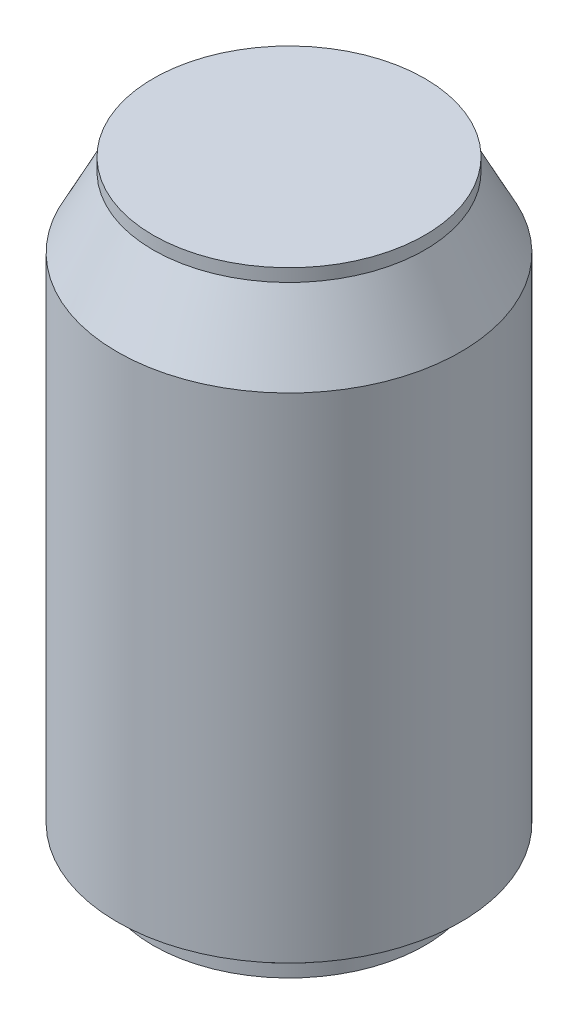
ISO-10303-21;
HEADER;
FILE_DESCRIPTION(('STEP AP214'),'2;1');
FILE_NAME('part.step','',(''),(''),'','','');
FILE_SCHEMA(('AUTOMOTIVE_DESIGN { 1 0 10303 214 1 1 1 1 }'));
ENDSEC;
DATA;
#1=APPLICATION_CONTEXT('core data for automotive mechanical design processes');
#2=APPLICATION_PROTOCOL_DEFINITION('international standard','automotive_design',2000,#1);
#3=PRODUCT_CONTEXT('',#1,'mechanical');
#4=PRODUCT('Part','Part','',(#3));
#5=PRODUCT_RELATED_PRODUCT_CATEGORY('part','',(#4));
#6=PRODUCT_DEFINITION_FORMATION('','',#4);
#7=PRODUCT_DEFINITION_CONTEXT('part definition',#1,'design');
#8=PRODUCT_DEFINITION('design','',#6,#7);
#9=PRODUCT_DEFINITION_SHAPE('','',#8);
#10=(LENGTH_UNIT() NAMED_UNIT(*) SI_UNIT(.MILLI.,.METRE.));
#11=(NAMED_UNIT(*) PLANE_ANGLE_UNIT() SI_UNIT($,.RADIAN.));
#12=(NAMED_UNIT(*) SI_UNIT($,.STERADIAN.) SOLID_ANGLE_UNIT());
#13=UNCERTAINTY_MEASURE_WITH_UNIT(LENGTH_MEASURE(1.E-05),#10,'distance_accuracy_value','');
#14=(GEOMETRIC_REPRESENTATION_CONTEXT(3) GLOBAL_UNCERTAINTY_ASSIGNED_CONTEXT((#13)) GLOBAL_UNIT_ASSIGNED_CONTEXT((#10,
#11,#12)) REPRESENTATION_CONTEXT('',''));
#15=CARTESIAN_POINT('',(0.,0.,0.));
#16=DIRECTION('',(0.,0.,1.));
#17=DIRECTION('',(1.,0.,0.));
#18=AXIS2_PLACEMENT_3D('',#15,#16,#17);
#19=CARTESIAN_POINT('',(26.9875,0.,0.));
#20=DIRECTION('',(0.,-1.,0.));
#21=DIRECTION('',(0.,0.,-1.));
#22=AXIS2_PLACEMENT_3D('',#19,#20,#21);
#23=PLANE('',#22);
#24=DIRECTION('',(0.,0.,-1.));
#25=VECTOR('',#24,1.);
#26=CARTESIAN_POINT('',(0.,0.,0.));
#27=LINE('',#26,#25);
#28=CARTESIAN_POINT('',(0.,0.,12.7));
#29=VERTEX_POINT('',#28);
#30=CARTESIAN_POINT('',(0.,0.,0.));
#31=VERTEX_POINT('',#30);
#32=EDGE_CURVE('E47',#29,#31,#27,.T.);
#33=ORIENTED_EDGE('',*,*,#32,.F.);
#34=DIRECTION('',(-1.,0.,0.));
#35=VECTOR('',#34,1.);
#36=CARTESIAN_POINT('',(0.,0.,12.7));
#37=LINE('',#36,#35);
#38=CARTESIAN_POINT('',(12.7,0.,12.7));
#39=VERTEX_POINT('',#38);
#40=EDGE_CURVE('E124',#39,#29,#37,.T.);
#41=ORIENTED_EDGE('',*,*,#40,.F.);
#42=DIRECTION('',(0.,0.,1.));
#43=VECTOR('',#42,1.);
#44=CARTESIAN_POINT('',(12.7,0.,0.));
#45=LINE('',#44,#43);
#46=CARTESIAN_POINT('',(12.7,0.,0.));
#47=VERTEX_POINT('',#46);
#48=EDGE_CURVE('E127',#47,#39,#45,.T.);
#49=ORIENTED_EDGE('',*,*,#48,.F.);
#50=DIRECTION('',(1.,0.,0.));
#51=VECTOR('',#50,1.);
#52=CARTESIAN_POINT('',(0.,0.,0.));
#53=LINE('',#52,#51);
#54=EDGE_CURVE('E133',#31,#47,#53,.T.);
#55=ORIENTED_EDGE('',*,*,#54,.F.);
#56=EDGE_LOOP('',(#33,#41,#49,#55));
#57=FACE_BOUND('',#56,.T.);
#58=CARTESIAN_POINT('',(0.,0.,0.));
#59=DIRECTION('',(0.,-1.,0.));
#60=DIRECTION('',(0.,0.,-1.));
#61=AXIS2_PLACEMENT_3D('',#58,#59,#60);
#62=CIRCLE('',#61,26.9875);
#63=CARTESIAN_POINT('',(0.,0.,-26.9875));
#64=VERTEX_POINT('',#63);
#65=EDGE_CURVE('E165',#64,#64,#62,.T.);
#66=ORIENTED_EDGE('',*,*,#65,.T.);
#67=EDGE_LOOP('',(#66));
#68=FACE_BOUND('',#67,.T.);
#69=ADVANCED_FACE('F33',(#57,#68),#23,.T.);
#70=CARTESIAN_POINT('',(0.,122.2375,0.));
#71=DIRECTION('',(0.,1.,0.));
#72=DIRECTION('',(0.,0.,1.));
#73=AXIS2_PLACEMENT_3D('',#70,#71,#72);
#74=PLANE('',#73);
#75=CARTESIAN_POINT('',(0.,122.2375,0.));
#76=DIRECTION('',(0.,-1.,0.));
#77=DIRECTION('',(0.,0.,-1.));
#78=AXIS2_PLACEMENT_3D('',#75,#76,#77);
#79=CIRCLE('',#78,26.9875);
#80=CARTESIAN_POINT('',(0.,122.2375,-26.9875));
#81=VERTEX_POINT('',#80);
#82=EDGE_CURVE('E181',#81,#81,#79,.T.);
#83=ORIENTED_EDGE('',*,*,#82,.F.);
#84=EDGE_LOOP('',(#83));
#85=FACE_BOUND('',#84,.T.);
#86=ADVANCED_FACE('F232',(#85),#74,.T.);
#87=CARTESIAN_POINT('',(0.,0.,0.));
#88=DIRECTION('',(0.,-1.,0.));
#89=DIRECTION('',(0.,0.,-1.));
#90=AXIS2_PLACEMENT_3D('',#87,#88,#89);
#91=CYLINDRICAL_SURFACE('',#90,26.9875);
#92=ORIENTED_EDGE('',*,*,#82,.T.);
#93=EDGE_LOOP('',(#92));
#94=FACE_BOUND('',#93,.T.);
#95=CARTESIAN_POINT('',(0.,119.6975,0.));
#96=DIRECTION('',(0.,-1.,0.));
#97=DIRECTION('',(0.,0.,-1.));
#98=AXIS2_PLACEMENT_3D('',#95,#96,#97);
#99=CIRCLE('',#98,26.9875);
#100=CARTESIAN_POINT('',(0.,119.6975,-26.9875));
#101=VERTEX_POINT('',#100);
#102=EDGE_CURVE('E179',#101,#101,#99,.T.);
#103=ORIENTED_EDGE('',*,*,#102,.F.);
#104=EDGE_LOOP('',(#103));
#105=FACE_BOUND('',#104,.T.);
#106=ADVANCED_FACE('F239',(#94,#105),#91,.T.);
#107=CARTESIAN_POINT('',(0.,105.7275,0.));
#108=DIRECTION('',(0.,-1.,0.));
#109=DIRECTION('',(0.,0.,-1.));
#110=AXIS2_PLACEMENT_3D('',#107,#108,#109);
#111=CONICAL_SURFACE('',#110,34.13125,0.47269713571459);
#112=ORIENTED_EDGE('',*,*,#102,.T.);
#113=EDGE_LOOP('',(#112));
#114=FACE_BOUND('',#113,.T.);
#115=CARTESIAN_POINT('',(0.,105.7275,0.));
#116=DIRECTION('',(0.,-1.,0.));
#117=DIRECTION('',(0.,0.,-1.));
#118=AXIS2_PLACEMENT_3D('',#115,#116,#117);
#119=CIRCLE('',#118,34.13125);
#120=CARTESIAN_POINT('',(0.,105.7275,-34.13125));
#121=VERTEX_POINT('',#120);
#122=EDGE_CURVE('E175',#121,#121,#119,.T.);
#123=ORIENTED_EDGE('',*,*,#122,.F.);
#124=EDGE_LOOP('',(#123));
#125=FACE_BOUND('',#124,.T.);
#126=ADVANCED_FACE('F259',(#114,#125),#111,.T.);
#127=CARTESIAN_POINT('',(0.,0.,0.));
#128=DIRECTION('',(0.,-1.,0.));
#129=DIRECTION('',(0.,0.,-1.));
#130=AXIS2_PLACEMENT_3D('',#127,#128,#129);
#131=CYLINDRICAL_SURFACE('',#130,34.13125);
#132=DIRECTION('',(0.,-1.,0.));
#133=VECTOR('',#132,1.);
#134=CARTESIAN_POINT('',(-32.7752437300243,0.,9.525));
#135=LINE('',#134,#133);
#136=CARTESIAN_POINT('',(-32.7752437300244,7.62,9.525));
#137=VERTEX_POINT('',#136);
#138=CARTESIAN_POINT('',(-32.7752437300243,26.67,9.525));
#139=VERTEX_POINT('',#138);
#140=EDGE_CURVE('E163',#137,#139,#135,.F.);
#141=ORIENTED_EDGE('',*,*,#140,.F.);
#142=CARTESIAN_POINT('',(0.,7.62,0.));
#143=DIRECTION('',(0.,-1.,0.));
#144=DIRECTION('',(0.,0.,-1.));
#145=AXIS2_PLACEMENT_3D('',#142,#143,#144);
#146=CIRCLE('',#145,34.13125);
#147=CARTESIAN_POINT('',(-32.7752437300244,7.62,-9.52500000000001));
#148=VERTEX_POINT('',#147);
#149=EDGE_CURVE('E171',#148,#137,#146,.T.);
#150=ORIENTED_EDGE('',*,*,#149,.F.);
#151=DIRECTION('',(0.,-1.,0.));
#152=VECTOR('',#151,1.);
#153=CARTESIAN_POINT('',(-32.7752437300243,0.,-9.52500000000001));
#154=LINE('',#153,#152);
#155=CARTESIAN_POINT('',(-32.7752437300243,26.67,-9.525));
#156=VERTEX_POINT('',#155);
#157=EDGE_CURVE('E156',#156,#148,#154,.T.);
#158=ORIENTED_EDGE('',*,*,#157,.F.);
#159=CARTESIAN_POINT('',(0.,26.67,0.));
#160=DIRECTION('',(0.,1.,0.));
#161=DIRECTION('',(0.,0.,1.));
#162=AXIS2_PLACEMENT_3D('',#159,#160,#161);
#163=CIRCLE('',#162,34.13125);
#164=CARTESIAN_POINT('',(-34.13125,26.67,0.));
#165=VERTEX_POINT('',#164);
#166=EDGE_CURVE('E36',#165,#156,#163,.F.);
#167=ORIENTED_EDGE('',*,*,#166,.F.);
#168=EDGE_CURVE('E11',#139,#165,#163,.F.);
#169=ORIENTED_EDGE('',*,*,#168,.F.);
#170=EDGE_LOOP('',(#141,#150,#158,#167,#169));
#171=FACE_BOUND('',#170,.T.);
#172=ORIENTED_EDGE('',*,*,#122,.T.);
#173=EDGE_LOOP('',(#172));
#174=FACE_BOUND('',#173,.T.);
#175=ADVANCED_FACE('F200',(#171,#174),#131,.T.);
#176=CARTESIAN_POINT('',(0.,2.54,0.));
#177=DIRECTION('',(0.,1.,0.));
#178=DIRECTION('',(0.,0.,1.));
#179=AXIS2_PLACEMENT_3D('',#176,#177,#178);
#180=CONICAL_SURFACE('',#179,26.9875,0.952652100859711);
#181=CARTESIAN_POINT('',(-34.13125,7.62,0.));
#182=VERTEX_POINT('',#181);
#183=EDGE_CURVE('E172',#137,#182,#146,.T.);
#184=ORIENTED_EDGE('',*,*,#183,.T.);
#185=EDGE_CURVE('E176',#182,#148,#146,.T.);
#186=ORIENTED_EDGE('',*,*,#185,.T.);
#187=ORIENTED_EDGE('',*,*,#149,.T.);
#188=EDGE_LOOP('',(#184,#186,#187));
#189=FACE_BOUND('',#188,.T.);
#190=CARTESIAN_POINT('',(0.,2.54,0.));
#191=DIRECTION('',(0.,-1.,0.));
#192=DIRECTION('',(0.,0.,-1.));
#193=AXIS2_PLACEMENT_3D('',#190,#191,#192);
#194=CIRCLE('',#193,26.9875);
#195=CARTESIAN_POINT('',(0.,2.54,-26.9875));
#196=VERTEX_POINT('',#195);
#197=EDGE_CURVE('E168',#196,#196,#194,.T.);
#198=ORIENTED_EDGE('',*,*,#197,.F.);
#199=EDGE_LOOP('',(#198));
#200=FACE_BOUND('',#199,.T.);
#201=ADVANCED_FACE('F206',(#189,#200),#180,.T.);
#202=CARTESIAN_POINT('',(0.,0.,0.));
#203=DIRECTION('',(0.,-1.,0.));
#204=DIRECTION('',(0.,0.,-1.));
#205=AXIS2_PLACEMENT_3D('',#202,#203,#204);
#206=CYLINDRICAL_SURFACE('',#205,26.9875);
#207=ORIENTED_EDGE('',*,*,#197,.T.);
#208=EDGE_LOOP('',(#207));
#209=FACE_BOUND('',#208,.T.);
#210=ORIENTED_EDGE('',*,*,#65,.F.);
#211=EDGE_LOOP('',(#210));
#212=FACE_BOUND('',#211,.T.);
#213=ADVANCED_FACE('F245',(#209,#212),#206,.T.);
#214=CARTESIAN_POINT('',(-26.51125,26.67,9.525));
#215=DIRECTION('',(0.,1.,0.));
#216=DIRECTION('',(0.,0.,1.));
#217=AXIS2_PLACEMENT_3D('',#214,#215,#216);
#218=PLANE('',#217);
#219=DIRECTION('',(-1.,0.,0.));
#220=VECTOR('',#219,1.);
#221=CARTESIAN_POINT('',(-26.51125,26.67,9.525));
#222=LINE('',#221,#220);
#223=CARTESIAN_POINT('',(-34.13125,26.67,9.525));
#224=VERTEX_POINT('',#223);
#225=EDGE_CURVE('E153',#139,#224,#222,.T.);
#226=ORIENTED_EDGE('',*,*,#225,.F.);
#227=ORIENTED_EDGE('',*,*,#168,.T.);
#228=DIRECTION('',(0.,0.,-1.));
#229=VECTOR('',#228,1.);
#230=CARTESIAN_POINT('',(-34.13125,26.67,9.525));
#231=LINE('',#230,#229);
#232=EDGE_CURVE('E146',#224,#165,#231,.T.);
#233=ORIENTED_EDGE('',*,*,#232,.F.);
#234=EDGE_LOOP('',(#226,#227,#233));
#235=FACE_BOUND('',#234,.T.);
#236=ADVANCED_FACE('F215',(#235),#218,.T.);
#237=CARTESIAN_POINT('',(-26.51125,7.62,9.525));
#238=DIRECTION('',(0.,-1.,0.));
#239=DIRECTION('',(0.,0.,-1.));
#240=AXIS2_PLACEMENT_3D('',#237,#238,#239);
#241=PLANE('',#240);
#242=DIRECTION('',(-1.,0.,0.));
#243=VECTOR('',#242,1.);
#244=CARTESIAN_POINT('',(-26.51125,7.62,-9.52500000000001));
#245=LINE('',#244,#243);
#246=CARTESIAN_POINT('',(-34.13125,7.62,-9.52500000000001));
#247=VERTEX_POINT('',#246);
#248=EDGE_CURVE('E157',#148,#247,#245,.T.);
#249=ORIENTED_EDGE('',*,*,#248,.F.);
#250=ORIENTED_EDGE('',*,*,#185,.F.);
#251=DIRECTION('',(0.,0.,1.));
#252=VECTOR('',#251,1.);
#253=CARTESIAN_POINT('',(-34.13125,7.62,9.525));
#254=LINE('',#253,#252);
#255=EDGE_CURVE('E55',#247,#182,#254,.T.);
#256=ORIENTED_EDGE('',*,*,#255,.F.);
#257=EDGE_LOOP('',(#249,#250,#256));
#258=FACE_BOUND('',#257,.T.);
#259=ADVANCED_FACE('F209',(#258),#241,.T.);
#260=CARTESIAN_POINT('',(-34.13125,0.,0.));
#261=DIRECTION('',(1.,0.,0.));
#262=DIRECTION('',(0.,0.,-1.));
#263=AXIS2_PLACEMENT_3D('',#260,#261,#262);
#264=PLANE('',#263);
#265=ORIENTED_EDGE('',*,*,#255,.T.);
#266=CARTESIAN_POINT('',(-34.13125,7.62,9.525));
#267=VERTEX_POINT('',#266);
#268=EDGE_CURVE('E151',#182,#267,#254,.T.);
#269=ORIENTED_EDGE('',*,*,#268,.T.);
#270=DIRECTION('',(0.,1.,0.));
#271=VECTOR('',#270,1.);
#272=CARTESIAN_POINT('',(-34.13125,26.67,9.525));
#273=LINE('',#272,#271);
#274=EDGE_CURVE('E139',#267,#224,#273,.T.);
#275=ORIENTED_EDGE('',*,*,#274,.T.);
#276=ORIENTED_EDGE('',*,*,#232,.T.);
#277=CARTESIAN_POINT('',(-34.13125,26.67,-9.525));
#278=VERTEX_POINT('',#277);
#279=EDGE_CURVE('E145',#165,#278,#231,.T.);
#280=ORIENTED_EDGE('',*,*,#279,.T.);
#281=DIRECTION('',(0.,-1.,0.));
#282=VECTOR('',#281,1.);
#283=CARTESIAN_POINT('',(-34.13125,26.67,-9.525));
#284=LINE('',#283,#282);
#285=EDGE_CURVE('E149',#278,#247,#284,.T.);
#286=ORIENTED_EDGE('',*,*,#285,.T.);
#287=EDGE_LOOP('',(#265,#269,#275,#276,#280,#286));
#288=FACE_BOUND('',#287,.T.);
#289=ADVANCED_FACE('F210',(#288),#264,.F.);
#290=CARTESIAN_POINT('',(-26.51125,26.67,9.525));
#291=DIRECTION('',(0.,0.,1.));
#292=DIRECTION('',(0.,-1.,0.));
#293=AXIS2_PLACEMENT_3D('',#290,#291,#292);
#294=PLANE('',#293);
#295=DIRECTION('',(-1.,0.,0.));
#296=VECTOR('',#295,1.);
#297=CARTESIAN_POINT('',(-26.51125,7.62,9.525));
#298=LINE('',#297,#296);
#299=EDGE_CURVE('E154',#137,#267,#298,.T.);
#300=ORIENTED_EDGE('',*,*,#299,.F.);
#301=ORIENTED_EDGE('',*,*,#140,.T.);
#302=ORIENTED_EDGE('',*,*,#225,.T.);
#303=ORIENTED_EDGE('',*,*,#274,.F.);
#304=EDGE_LOOP('',(#300,#301,#302,#303));
#305=FACE_BOUND('',#304,.T.);
#306=ADVANCED_FACE('F218',(#305),#294,.T.);
#307=ORIENTED_EDGE('',*,*,#268,.F.);
#308=ORIENTED_EDGE('',*,*,#183,.F.);
#309=ORIENTED_EDGE('',*,*,#299,.T.);
#310=EDGE_LOOP('',(#307,#308,#309));
#311=FACE_BOUND('',#310,.T.);
#312=ADVANCED_FACE('F220',(#311),#241,.T.);
#313=CARTESIAN_POINT('',(-26.51125,26.67,-9.525));
#314=DIRECTION('',(0.,0.,-1.));
#315=DIRECTION('',(0.,1.,0.));
#316=AXIS2_PLACEMENT_3D('',#313,#314,#315);
#317=PLANE('',#316);
#318=DIRECTION('',(-1.,0.,0.));
#319=VECTOR('',#318,1.);
#320=CARTESIAN_POINT('',(-26.51125,26.67,-9.525));
#321=LINE('',#320,#319);
#322=EDGE_CURVE('E159',#156,#278,#321,.T.);
#323=ORIENTED_EDGE('',*,*,#322,.F.);
#324=ORIENTED_EDGE('',*,*,#157,.T.);
#325=ORIENTED_EDGE('',*,*,#248,.T.);
#326=ORIENTED_EDGE('',*,*,#285,.F.);
#327=EDGE_LOOP('',(#323,#324,#325,#326));
#328=FACE_BOUND('',#327,.T.);
#329=ADVANCED_FACE('F196',(#328),#317,.T.);
#330=ORIENTED_EDGE('',*,*,#279,.F.);
#331=ORIENTED_EDGE('',*,*,#166,.T.);
#332=ORIENTED_EDGE('',*,*,#322,.T.);
#333=EDGE_LOOP('',(#330,#331,#332));
#334=FACE_BOUND('',#333,.T.);
#335=ADVANCED_FACE('F189',(#334),#218,.T.);
#336=CARTESIAN_POINT('',(0.,25.4,0.));
#337=DIRECTION('',(-1.,0.,0.));
#338=DIRECTION('',(0.,0.,1.));
#339=AXIS2_PLACEMENT_3D('',#336,#337,#338);
#340=PLANE('',#339);
#341=ORIENTED_EDGE('',*,*,#32,.T.);
#342=DIRECTION('',(0.,-1.,0.));
#343=VECTOR('',#342,1.);
#344=CARTESIAN_POINT('',(0.,25.4,0.));
#345=LINE('',#344,#343);
#346=CARTESIAN_POINT('',(0.,25.4,0.));
#347=VERTEX_POINT('',#346);
#348=EDGE_CURVE('E102',#347,#31,#345,.T.);
#349=ORIENTED_EDGE('',*,*,#348,.F.);
#350=DIRECTION('',(0.,0.,-1.));
#351=VECTOR('',#350,1.);
#352=CARTESIAN_POINT('',(0.,25.4,0.));
#353=LINE('',#352,#351);
#354=CARTESIAN_POINT('',(0.,25.4,12.7));
#355=VERTEX_POINT('',#354);
#356=EDGE_CURVE('E106',#355,#347,#353,.T.);
#357=ORIENTED_EDGE('',*,*,#356,.F.);
#358=DIRECTION('',(0.,-1.,0.));
#359=VECTOR('',#358,1.);
#360=CARTESIAN_POINT('',(0.,25.4,12.7));
#361=LINE('',#360,#359);
#362=EDGE_CURVE('E137',#355,#29,#361,.T.);
#363=ORIENTED_EDGE('',*,*,#362,.T.);
#364=EDGE_LOOP('',(#341,#349,#357,#363));
#365=FACE_BOUND('',#364,.T.);
#366=ADVANCED_FACE('F104',(#365),#340,.F.);
#367=CARTESIAN_POINT('',(0.,25.4,12.7));
#368=DIRECTION('',(0.,0.,1.));
#369=DIRECTION('',(1.,0.,0.));
#370=AXIS2_PLACEMENT_3D('',#367,#368,#369);
#371=PLANE('',#370);
#372=ORIENTED_EDGE('',*,*,#40,.T.);
#373=ORIENTED_EDGE('',*,*,#362,.F.);
#374=DIRECTION('',(-1.,0.,0.));
#375=VECTOR('',#374,1.);
#376=CARTESIAN_POINT('',(0.,25.4,12.7));
#377=LINE('',#376,#375);
#378=CARTESIAN_POINT('',(12.7,25.4,12.7));
#379=VERTEX_POINT('',#378);
#380=EDGE_CURVE('E112',#379,#355,#377,.T.);
#381=ORIENTED_EDGE('',*,*,#380,.F.);
#382=DIRECTION('',(0.,-1.,0.));
#383=VECTOR('',#382,1.);
#384=CARTESIAN_POINT('',(12.7,25.4,12.7));
#385=LINE('',#384,#383);
#386=EDGE_CURVE('E140',#379,#39,#385,.T.);
#387=ORIENTED_EDGE('',*,*,#386,.T.);
#388=EDGE_LOOP('',(#372,#373,#381,#387));
#389=FACE_BOUND('',#388,.T.);
#390=ADVANCED_FACE('F335',(#389),#371,.F.);
#391=CARTESIAN_POINT('',(12.7,25.4,0.));
#392=DIRECTION('',(1.,0.,0.));
#393=DIRECTION('',(0.,0.,-1.));
#394=AXIS2_PLACEMENT_3D('',#391,#392,#393);
#395=PLANE('',#394);
#396=ORIENTED_EDGE('',*,*,#48,.T.);
#397=ORIENTED_EDGE('',*,*,#386,.F.);
#398=DIRECTION('',(0.,0.,1.));
#399=VECTOR('',#398,1.);
#400=CARTESIAN_POINT('',(12.7,25.4,0.));
#401=LINE('',#400,#399);
#402=CARTESIAN_POINT('',(12.7,25.4,0.));
#403=VERTEX_POINT('',#402);
#404=EDGE_CURVE('E120',#403,#379,#401,.T.);
#405=ORIENTED_EDGE('',*,*,#404,.F.);
#406=DIRECTION('',(0.,-1.,0.));
#407=VECTOR('',#406,1.);
#408=CARTESIAN_POINT('',(12.7,25.4,0.));
#409=LINE('',#408,#407);
#410=EDGE_CURVE('E111',#403,#47,#409,.T.);
#411=ORIENTED_EDGE('',*,*,#410,.T.);
#412=EDGE_LOOP('',(#396,#397,#405,#411));
#413=FACE_BOUND('',#412,.T.);
#414=ADVANCED_FACE('F341',(#413),#395,.F.);
#415=CARTESIAN_POINT('',(0.,25.4,0.));
#416=DIRECTION('',(0.,0.,-1.));
#417=DIRECTION('',(-1.,0.,0.));
#418=AXIS2_PLACEMENT_3D('',#415,#416,#417);
#419=PLANE('',#418);
#420=ORIENTED_EDGE('',*,*,#54,.T.);
#421=ORIENTED_EDGE('',*,*,#410,.F.);
#422=DIRECTION('',(1.,0.,0.));
#423=VECTOR('',#422,1.);
#424=CARTESIAN_POINT('',(0.,25.4,0.));
#425=LINE('',#424,#423);
#426=EDGE_CURVE('E115',#347,#403,#425,.T.);
#427=ORIENTED_EDGE('',*,*,#426,.F.);
#428=ORIENTED_EDGE('',*,*,#348,.T.);
#429=EDGE_LOOP('',(#420,#421,#427,#428));
#430=FACE_BOUND('',#429,.T.);
#431=ADVANCED_FACE('F116',(#430),#419,.F.);
#432=CARTESIAN_POINT('',(0.,25.4,0.));
#433=DIRECTION('',(0.,1.,0.));
#434=DIRECTION('',(0.,0.,1.));
#435=AXIS2_PLACEMENT_3D('',#432,#433,#434);
#436=PLANE('',#435);
#437=ORIENTED_EDGE('',*,*,#356,.T.);
#438=ORIENTED_EDGE('',*,*,#426,.T.);
#439=ORIENTED_EDGE('',*,*,#404,.T.);
#440=ORIENTED_EDGE('',*,*,#380,.T.);
#441=EDGE_LOOP('',(#437,#438,#439,#440));
#442=FACE_BOUND('',#441,.T.);
#443=ADVANCED_FACE('F122',(#442),#436,.F.);
#444=CLOSED_SHELL('',(#69,#86,#106,#126,#175,#201,#213,#236,#259,#289,#306,#312,#329,#335,#366,
#390,#414,#431,#443));
#445=MANIFOLD_SOLID_BREP('B2',#444);
#446=ADVANCED_BREP_SHAPE_REPRESENTATION('',(#18,#445),#14);
#447=SHAPE_DEFINITION_REPRESENTATION(#9,#446);
ENDSEC;
END-ISO-10303-21;
